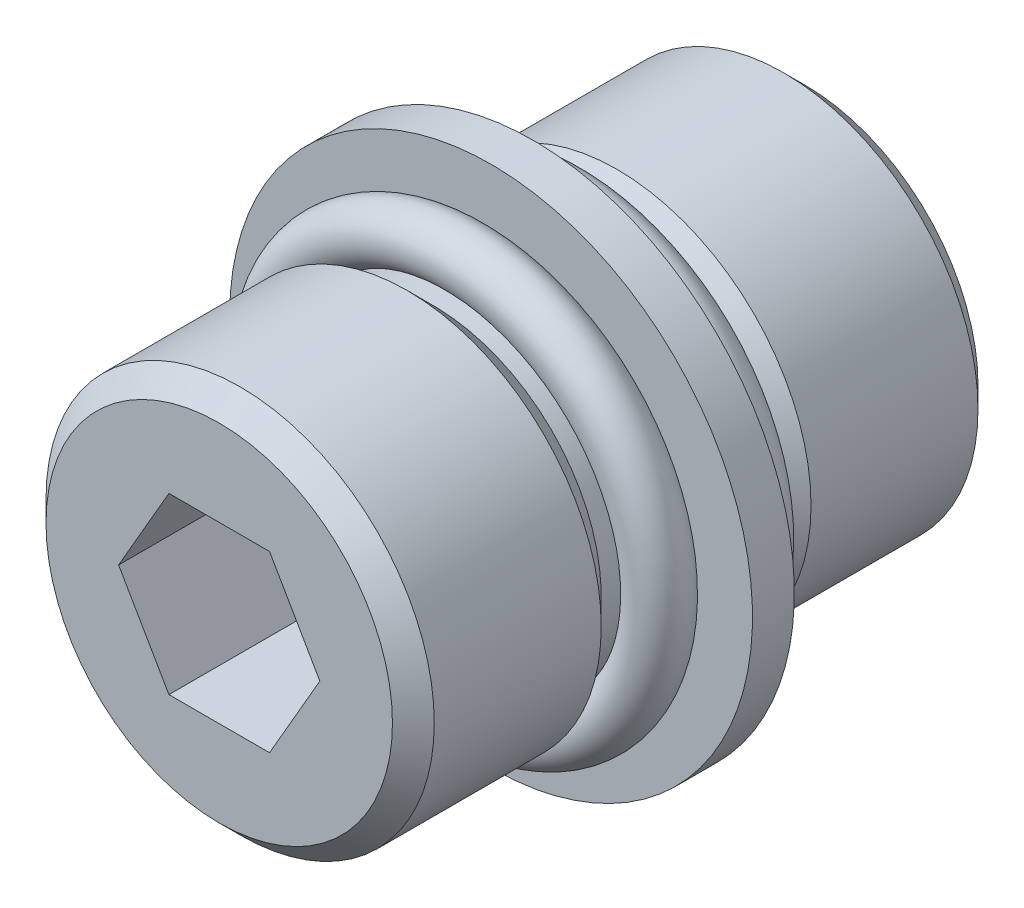
ISO-10303-21;
HEADER;
FILE_DESCRIPTION(('STEP AP214'),'2;1');
FILE_NAME('part.step','',(''),(''),'','','');
FILE_SCHEMA(('AUTOMOTIVE_DESIGN { 1 0 10303 214 1 1 1 1 }'));
ENDSEC;
DATA;
#1=APPLICATION_CONTEXT('core data for automotive mechanical design processes');
#2=APPLICATION_PROTOCOL_DEFINITION('international standard','automotive_design',2000,#1);
#3=PRODUCT_CONTEXT('',#1,'mechanical');
#4=PRODUCT('Part','Part','',(#3));
#5=PRODUCT_RELATED_PRODUCT_CATEGORY('part','',(#4));
#6=PRODUCT_DEFINITION_FORMATION('','',#4);
#7=PRODUCT_DEFINITION_CONTEXT('part definition',#1,'design');
#8=PRODUCT_DEFINITION('design','',#6,#7);
#9=PRODUCT_DEFINITION_SHAPE('','',#8);
#10=(LENGTH_UNIT() NAMED_UNIT(*) SI_UNIT(.MILLI.,.METRE.));
#11=(NAMED_UNIT(*) PLANE_ANGLE_UNIT() SI_UNIT($,.RADIAN.));
#12=(NAMED_UNIT(*) SI_UNIT($,.STERADIAN.) SOLID_ANGLE_UNIT());
#13=UNCERTAINTY_MEASURE_WITH_UNIT(LENGTH_MEASURE(1.E-05),#10,'distance_accuracy_value','');
#14=(GEOMETRIC_REPRESENTATION_CONTEXT(3) GLOBAL_UNCERTAINTY_ASSIGNED_CONTEXT((#13)) GLOBAL_UNIT_ASSIGNED_CONTEXT((#10,
#11,#12)) REPRESENTATION_CONTEXT('',''));
#15=CARTESIAN_POINT('',(0.,0.,0.));
#16=DIRECTION('',(0.,0.,1.));
#17=DIRECTION('',(1.,0.,0.));
#18=AXIS2_PLACEMENT_3D('',#15,#16,#17);
#19=CARTESIAN_POINT('',(0.,0.,2.794));
#20=DIRECTION('',(0.,0.,-1.));
#21=DIRECTION('',(-1.,0.,0.));
#22=AXIS2_PLACEMENT_3D('',#19,#20,#21);
#23=PLANE('',#22);
#24=CARTESIAN_POINT('',(0.,0.,2.794));
#25=DIRECTION('',(0.,0.,-1.));
#26=DIRECTION('',(-1.,0.,0.));
#27=AXIS2_PLACEMENT_3D('',#24,#25,#26);
#28=CIRCLE('',#27,4.9784);
#29=CARTESIAN_POINT('',(-4.9784,0.,2.794));
#30=VERTEX_POINT('',#29);
#31=EDGE_CURVE('P0_E143',#30,#30,#28,.T.);
#32=ORIENTED_EDGE('',*,*,#31,.T.);
#33=EDGE_LOOP('',(#32));
#34=FACE_BOUND('',#33,.T.);
#35=ADVANCED_FACE('P0_F16',(#34),#23,.T.);
#36=CARTESIAN_POINT('',(0.,0.,22.4028));
#37=DIRECTION('',(0.,0.,-1.));
#38=DIRECTION('',(-1.,0.,0.));
#39=AXIS2_PLACEMENT_3D('',#36,#37,#38);
#40=CYLINDRICAL_SURFACE('',#39,4.9784);
#41=CARTESIAN_POINT('',(0.,0.,0.));
#42=DIRECTION('',(0.,0.,-1.));
#43=DIRECTION('',(-1.,0.,0.));
#44=AXIS2_PLACEMENT_3D('',#41,#42,#43);
#45=CIRCLE('',#44,4.9784);
#46=CARTESIAN_POINT('',(-4.9784,0.,0.));
#47=VERTEX_POINT('',#46);
#48=EDGE_CURVE('P0_E139',#47,#47,#45,.F.);
#49=ORIENTED_EDGE('',*,*,#48,.F.);
#50=EDGE_LOOP('',(#49));
#51=FACE_BOUND('',#50,.T.);
#52=ORIENTED_EDGE('',*,*,#31,.F.);
#53=EDGE_LOOP('',(#52));
#54=FACE_BOUND('',#53,.T.);
#55=ADVANCED_FACE('P0_F468',(#51,#54),#40,.F.);
#56=CARTESIAN_POINT('',(0.,0.,0.));
#57=DIRECTION('',(0.,0.,-1.));
#58=DIRECTION('',(-1.,0.,0.));
#59=AXIS2_PLACEMENT_3D('',#56,#57,#58);
#60=PLANE('',#59);
#61=ORIENTED_EDGE('',*,*,#48,.T.);
#62=EDGE_LOOP('',(#61));
#63=FACE_BOUND('',#62,.T.);
#64=CARTESIAN_POINT('',(0.,0.,0.));
#65=DIRECTION('',(0.,0.,1.));
#66=DIRECTION('',(1.,0.,0.));
#67=AXIS2_PLACEMENT_3D('',#64,#65,#66);
#68=CIRCLE('',#67,6.3118999999574);
#69=CARTESIAN_POINT('',(6.3118999999574,0.,0.));
#70=VERTEX_POINT('',#69);
#71=EDGE_CURVE('P0_E103',#70,#70,#68,.T.);
#72=ORIENTED_EDGE('',*,*,#71,.F.);
#73=EDGE_LOOP('',(#72));
#74=FACE_BOUND('',#73,.T.);
#75=ADVANCED_FACE('P0_F461',(#63,#74),#60,.T.);
#76=CARTESIAN_POINT('',(0.,0.,7.62));
#77=DIRECTION('',(0.,0.,-1.));
#78=DIRECTION('',(-1.,0.,0.));
#79=AXIS2_PLACEMENT_3D('',#76,#77,#78);
#80=PLANE('',#79);
#81=DIRECTION('',(1.,0.,0.));
#82=VECTOR('',#81,1.);
#83=CARTESIAN_POINT('',(-1.83308710467698,-3.175,7.62));
#84=LINE('',#83,#82);
#85=CARTESIAN_POINT('',(-1.83308710467695,-3.17499999999998,7.62));
#86=VERTEX_POINT('',#85);
#87=CARTESIAN_POINT('',(1.83308710467698,-3.175,7.62));
#88=VERTEX_POINT('',#87);
#89=EDGE_CURVE('P0_E78',#86,#88,#84,.T.);
#90=ORIENTED_EDGE('',*,*,#89,.T.);
#91=DIRECTION('',(0.500000000000017,0.866025403784429,0.));
#92=VECTOR('',#91,1.);
#93=CARTESIAN_POINT('',(1.83308710467698,-3.175,7.62));
#94=LINE('',#93,#92);
#95=CARTESIAN_POINT('',(3.66617420935399,0.,7.62));
#96=VERTEX_POINT('',#95);
#97=EDGE_CURVE('P0_E295',#88,#96,#94,.T.);
#98=ORIENTED_EDGE('',*,*,#97,.T.);
#99=DIRECTION('',(-0.500000000000017,0.866025403784429,0.));
#100=VECTOR('',#99,1.);
#101=CARTESIAN_POINT('',(3.66617420935396,0.,7.62));
#102=LINE('',#101,#100);
#103=CARTESIAN_POINT('',(1.83308710467695,3.17499999999998,7.62));
#104=VERTEX_POINT('',#103);
#105=EDGE_CURVE('P0_E289',#96,#104,#102,.T.);
#106=ORIENTED_EDGE('',*,*,#105,.T.);
#107=DIRECTION('',(1.,0.,0.));
#108=VECTOR('',#107,1.);
#109=CARTESIAN_POINT('',(1.83308710467698,3.175,7.62));
#110=LINE('',#109,#108);
#111=CARTESIAN_POINT('',(-1.83308710467698,3.175,7.62));
#112=VERTEX_POINT('',#111);
#113=EDGE_CURVE('P0_E98',#104,#112,#110,.F.);
#114=ORIENTED_EDGE('',*,*,#113,.T.);
#115=DIRECTION('',(-0.500000000000017,-0.866025403784429,0.));
#116=VECTOR('',#115,1.);
#117=CARTESIAN_POINT('',(-1.83308710467698,3.175,7.62));
#118=LINE('',#117,#116);
#119=CARTESIAN_POINT('',(-3.66617420935399,0.,7.62));
#120=VERTEX_POINT('',#119);
#121=EDGE_CURVE('P0_E93',#112,#120,#118,.T.);
#122=ORIENTED_EDGE('',*,*,#121,.T.);
#123=DIRECTION('',(0.500000000000017,-0.866025403784429,0.));
#124=VECTOR('',#123,1.);
#125=CARTESIAN_POINT('',(-3.66617420935396,0.,7.62));
#126=LINE('',#125,#124);
#127=EDGE_CURVE('P0_E83',#120,#86,#126,.T.);
#128=ORIENTED_EDGE('',*,*,#127,.T.);
#129=EDGE_LOOP('',(#90,#98,#106,#114,#122,#128));
#130=FACE_BOUND('',#129,.T.);
#131=ADVANCED_FACE('P0_F96',(#130),#80,.F.);
#132=CARTESIAN_POINT('',(0.,0.,0.761999999951968));
#133=DIRECTION('',(0.,0.,1.));
#134=DIRECTION('',(1.,0.,0.));
#135=AXIS2_PLACEMENT_3D('',#132,#133,#134);
#136=CONICAL_SURFACE('',#135,7.07389999990937,0.785398163397448);
#137=ORIENTED_EDGE('',*,*,#71,.T.);
#138=EDGE_LOOP('',(#137));
#139=FACE_BOUND('',#138,.T.);
#140=CARTESIAN_POINT('',(0.,0.,0.761999999999999));
#141=DIRECTION('',(0.,0.,-1.));
#142=DIRECTION('',(-1.,0.,0.));
#143=AXIS2_PLACEMENT_3D('',#140,#141,#142);
#144=CIRCLE('',#143,7.0739);
#145=CARTESIAN_POINT('',(-7.0739,0.,0.761999999999999));
#146=VERTEX_POINT('',#145);
#147=EDGE_CURVE('P0_E115',#146,#146,#144,.F.);
#148=ORIENTED_EDGE('',*,*,#147,.F.);
#149=EDGE_LOOP('',(#148));
#150=FACE_BOUND('',#149,.T.);
#151=ADVANCED_FACE('P0_F447',(#139,#150),#136,.T.);
#152=CARTESIAN_POINT('',(-1.83308710467698,3.175,21.336));
#153=DIRECTION('',(-0.866025403784429,0.500000000000017,0.));
#154=DIRECTION('',(-0.500000000000017,-0.866025403784429,0.));
#155=AXIS2_PLACEMENT_3D('',#152,#153,#154);
#156=PLANE('',#155);
#157=DIRECTION('',(-0.499999999999983,-0.866025403784448,0.));
#158=VECTOR('',#157,1.);
#159=CARTESIAN_POINT('',(-1.83308710467698,3.175,21.336));
#160=LINE('',#159,#158);
#161=CARTESIAN_POINT('',(-1.83308710467698,3.175,21.336));
#162=VERTEX_POINT('',#161);
#163=CARTESIAN_POINT('',(-3.66617420935402,0.,21.336));
#164=VERTEX_POINT('',#163);
#165=EDGE_CURVE('P0_E107',#162,#164,#160,.T.);
#166=ORIENTED_EDGE('',*,*,#165,.T.);
#167=DIRECTION('',(0.,0.,1.));
#168=VECTOR('',#167,1.);
#169=CARTESIAN_POINT('',(-3.66617420935396,0.,21.336));
#170=LINE('',#169,#168);
#171=EDGE_CURVE('P0_E88',#164,#120,#170,.F.);
#172=ORIENTED_EDGE('',*,*,#171,.T.);
#173=ORIENTED_EDGE('',*,*,#121,.F.);
#174=DIRECTION('',(0.,0.,1.));
#175=VECTOR('',#174,1.);
#176=CARTESIAN_POINT('',(-1.83308710467698,3.175,21.336));
#177=LINE('',#176,#175);
#178=EDGE_CURVE('P0_E280',#112,#162,#177,.T.);
#179=ORIENTED_EDGE('',*,*,#178,.T.);
#180=EDGE_LOOP('',(#166,#172,#173,#179));
#181=FACE_BOUND('',#180,.T.);
#182=ADVANCED_FACE('P0_F106',(#181),#156,.F.);
#183=CARTESIAN_POINT('',(-3.66617420935396,0.,21.336));
#184=DIRECTION('',(-0.866025403784429,-0.500000000000017,0.));
#185=DIRECTION('',(0.500000000000017,-0.866025403784429,0.));
#186=AXIS2_PLACEMENT_3D('',#183,#184,#185);
#187=PLANE('',#186);
#188=DIRECTION('',(0.499999999999983,-0.866025403784448,0.));
#189=VECTOR('',#188,1.);
#190=CARTESIAN_POINT('',(-3.66617420935396,0.,21.336));
#191=LINE('',#190,#189);
#192=CARTESIAN_POINT('',(-1.83308710467692,-3.17499999999996,21.336));
#193=VERTEX_POINT('',#192);
#194=EDGE_CURVE('P0_E269',#164,#193,#191,.T.);
#195=ORIENTED_EDGE('',*,*,#194,.T.);
#196=DIRECTION('',(0.,0.,-1.));
#197=VECTOR('',#196,1.);
#198=CARTESIAN_POINT('',(-1.83308710467698,-3.175,21.336));
#199=LINE('',#198,#197);
#200=EDGE_CURVE('P0_E90',#193,#86,#199,.T.);
#201=ORIENTED_EDGE('',*,*,#200,.T.);
#202=ORIENTED_EDGE('',*,*,#127,.F.);
#203=ORIENTED_EDGE('',*,*,#171,.F.);
#204=EDGE_LOOP('',(#195,#201,#202,#203));
#205=FACE_BOUND('',#204,.T.);
#206=ADVANCED_FACE('P0_F86',(#205),#187,.F.);
#207=CARTESIAN_POINT('',(-1.83308710467698,-3.175,21.336));
#208=DIRECTION('',(0.,-1.,0.));
#209=DIRECTION('',(0.,0.,-1.));
#210=AXIS2_PLACEMENT_3D('',#207,#208,#209);
#211=PLANE('',#210);
#212=DIRECTION('',(-1.,0.,0.));
#213=VECTOR('',#212,1.);
#214=CARTESIAN_POINT('',(0.,-3.175,21.336));
#215=LINE('',#214,#213);
#216=CARTESIAN_POINT('',(1.83308710467698,-3.175,21.336));
#217=VERTEX_POINT('',#216);
#218=EDGE_CURVE('P0_E265',#193,#217,#215,.F.);
#219=ORIENTED_EDGE('',*,*,#218,.T.);
#220=DIRECTION('',(0.,0.,1.));
#221=VECTOR('',#220,1.);
#222=CARTESIAN_POINT('',(1.83308710467698,-3.175,21.336));
#223=LINE('',#222,#221);
#224=EDGE_CURVE('P0_E292',#217,#88,#223,.F.);
#225=ORIENTED_EDGE('',*,*,#224,.T.);
#226=ORIENTED_EDGE('',*,*,#89,.F.);
#227=ORIENTED_EDGE('',*,*,#200,.F.);
#228=EDGE_LOOP('',(#219,#225,#226,#227));
#229=FACE_BOUND('',#228,.T.);
#230=ADVANCED_FACE('P0_F427',(#229),#211,.F.);
#231=CARTESIAN_POINT('',(1.83308710467698,-3.175,21.336));
#232=DIRECTION('',(0.866025403784429,-0.500000000000017,0.));
#233=DIRECTION('',(0.500000000000017,0.866025403784429,0.));
#234=AXIS2_PLACEMENT_3D('',#231,#232,#233);
#235=PLANE('',#234);
#236=DIRECTION('',(0.499999999999983,0.866025403784448,0.));
#237=VECTOR('',#236,1.);
#238=CARTESIAN_POINT('',(1.83308710467698,-3.175,21.336));
#239=LINE('',#238,#237);
#240=CARTESIAN_POINT('',(3.66617420935402,0.,21.336));
#241=VERTEX_POINT('',#240);
#242=EDGE_CURVE('P0_E261',#217,#241,#239,.T.);
#243=ORIENTED_EDGE('',*,*,#242,.T.);
#244=DIRECTION('',(0.,0.,1.));
#245=VECTOR('',#244,1.);
#246=CARTESIAN_POINT('',(3.66617420935396,0.,21.336));
#247=LINE('',#246,#245);
#248=EDGE_CURVE('P0_E285',#241,#96,#247,.F.);
#249=ORIENTED_EDGE('',*,*,#248,.T.);
#250=ORIENTED_EDGE('',*,*,#97,.F.);
#251=ORIENTED_EDGE('',*,*,#224,.F.);
#252=EDGE_LOOP('',(#243,#249,#250,#251));
#253=FACE_BOUND('',#252,.T.);
#254=ADVANCED_FACE('P0_F419',(#253),#235,.F.);
#255=CARTESIAN_POINT('',(3.66617420935396,0.,21.336));
#256=DIRECTION('',(0.866025403784429,0.500000000000017,0.));
#257=DIRECTION('',(-0.500000000000017,0.866025403784429,0.));
#258=AXIS2_PLACEMENT_3D('',#255,#256,#257);
#259=PLANE('',#258);
#260=DIRECTION('',(-0.499999999999983,0.866025403784448,0.));
#261=VECTOR('',#260,1.);
#262=CARTESIAN_POINT('',(3.66617420935396,0.,21.336));
#263=LINE('',#262,#261);
#264=CARTESIAN_POINT('',(1.83308710467692,3.17499999999996,21.336));
#265=VERTEX_POINT('',#264);
#266=EDGE_CURVE('P0_E257',#241,#265,#263,.T.);
#267=ORIENTED_EDGE('',*,*,#266,.T.);
#268=DIRECTION('',(0.,0.,1.));
#269=VECTOR('',#268,1.);
#270=CARTESIAN_POINT('',(1.83308710467698,3.175,21.336));
#271=LINE('',#270,#269);
#272=EDGE_CURVE('P0_E119',#265,#104,#271,.F.);
#273=ORIENTED_EDGE('',*,*,#272,.T.);
#274=ORIENTED_EDGE('',*,*,#105,.F.);
#275=ORIENTED_EDGE('',*,*,#248,.F.);
#276=EDGE_LOOP('',(#267,#273,#274,#275));
#277=FACE_BOUND('',#276,.T.);
#278=ADVANCED_FACE('P0_F411',(#277),#259,.F.);
#279=CARTESIAN_POINT('',(1.83308710467698,3.175,21.336));
#280=DIRECTION('',(0.,1.,0.));
#281=DIRECTION('',(0.,0.,1.));
#282=AXIS2_PLACEMENT_3D('',#279,#280,#281);
#283=PLANE('',#282);
#284=DIRECTION('',(-1.,0.,0.));
#285=VECTOR('',#284,1.);
#286=CARTESIAN_POINT('',(0.,3.175,21.336));
#287=LINE('',#286,#285);
#288=EDGE_CURVE('P0_E253',#265,#162,#287,.T.);
#289=ORIENTED_EDGE('',*,*,#288,.T.);
#290=ORIENTED_EDGE('',*,*,#178,.F.);
#291=ORIENTED_EDGE('',*,*,#113,.F.);
#292=ORIENTED_EDGE('',*,*,#272,.F.);
#293=EDGE_LOOP('',(#289,#290,#291,#292));
#294=FACE_BOUND('',#293,.T.);
#295=ADVANCED_FACE('P0_F403',(#294),#283,.F.);
#296=CARTESIAN_POINT('',(0.,0.,22.4028));
#297=DIRECTION('',(0.,0.,-1.));
#298=DIRECTION('',(-1.,0.,0.));
#299=AXIS2_PLACEMENT_3D('',#296,#297,#298);
#300=CYLINDRICAL_SURFACE('',#299,7.0739);
#301=CARTESIAN_POINT('',(0.,0.,6.84530000006589));
#302=DIRECTION('',(0.,0.,-1.));
#303=DIRECTION('',(0.,-1.,0.));
#304=AXIS2_PLACEMENT_3D('',#301,#302,#303);
#305=CIRCLE('',#304,7.07389999996622);
#306=CARTESIAN_POINT('',(0.,-7.07389999996622,6.84530000006589));
#307=VERTEX_POINT('',#306);
#308=EDGE_CURVE('P0_E135',#307,#307,#305,.F.);
#309=ORIENTED_EDGE('',*,*,#308,.F.);
#310=EDGE_LOOP('',(#309));
#311=FACE_BOUND('',#310,.T.);
#312=ORIENTED_EDGE('',*,*,#147,.T.);
#313=EDGE_LOOP('',(#312));
#314=FACE_BOUND('',#313,.T.);
#315=ADVANCED_FACE('P0_F395',(#311,#314),#300,.T.);
#316=CARTESIAN_POINT('',(0.,0.,21.336));
#317=DIRECTION('',(0.,0.,-1.));
#318=DIRECTION('',(-1.,0.,0.));
#319=AXIS2_PLACEMENT_3D('',#316,#317,#318);
#320=PLANE('',#319);
#321=ORIENTED_EDGE('',*,*,#266,.F.);
#322=ORIENTED_EDGE('',*,*,#242,.F.);
#323=ORIENTED_EDGE('',*,*,#218,.F.);
#324=ORIENTED_EDGE('',*,*,#194,.F.);
#325=ORIENTED_EDGE('',*,*,#165,.F.);
#326=ORIENTED_EDGE('',*,*,#288,.F.);
#327=EDGE_LOOP('',(#321,#322,#323,#324,#325,#326));
#328=FACE_BOUND('',#327,.T.);
#329=CARTESIAN_POINT('',(0.,0.,21.3359999999625));
#330=DIRECTION('',(0.,0.,-1.));
#331=DIRECTION('',(-1.,0.,0.));
#332=AXIS2_PLACEMENT_3D('',#329,#330,#331);
#333=CIRCLE('',#332,6.3118999999574);
#334=CARTESIAN_POINT('',(-6.3118999999574,0.,21.3359999999625));
#335=VERTEX_POINT('',#334);
#336=EDGE_CURVE('P0_E130',#335,#335,#333,.T.);
#337=ORIENTED_EDGE('',*,*,#336,.F.);
#338=EDGE_LOOP('',(#337));
#339=FACE_BOUND('',#338,.T.);
#340=ADVANCED_FACE('P0_F387',(#328,#339),#320,.F.);
#341=CARTESIAN_POINT('',(0.,0.,6.84530000012273));
#342=DIRECTION('',(0.,0.,-1.));
#343=DIRECTION('',(-1.,0.,0.));
#344=AXIS2_PLACEMENT_3D('',#341,#342,#343);
#345=CONICAL_SURFACE('',#344,7.07389999990937,0.785398163397448);
#346=CARTESIAN_POINT('',(0.,0.,7.7978));
#347=DIRECTION('',(0.,0.,-1.));
#348=DIRECTION('',(-1.,0.,0.));
#349=AXIS2_PLACEMENT_3D('',#346,#347,#348);
#350=CIRCLE('',#349,6.1214);
#351=CARTESIAN_POINT('',(-6.1214,0.,7.7978));
#352=VERTEX_POINT('',#351);
#353=EDGE_CURVE('P0_E134',#352,#352,#350,.F.);
#354=ORIENTED_EDGE('',*,*,#353,.F.);
#355=EDGE_LOOP('',(#354));
#356=FACE_BOUND('',#355,.T.);
#357=ORIENTED_EDGE('',*,*,#308,.T.);
#358=EDGE_LOOP('',(#357));
#359=FACE_BOUND('',#358,.T.);
#360=ADVANCED_FACE('P0_F379',(#356,#359),#345,.T.);
#361=CARTESIAN_POINT('',(0.,0.,20.5740000000105));
#362=DIRECTION('',(0.,0.,-1.));
#363=DIRECTION('',(-1.,0.,0.));
#364=AXIS2_PLACEMENT_3D('',#361,#362,#363);
#365=CONICAL_SURFACE('',#364,7.07389999996622,0.785398163434747);
#366=CARTESIAN_POINT('',(0.,0.,20.574));
#367=DIRECTION('',(0.,0.,-1.));
#368=DIRECTION('',(-1.,0.,0.));
#369=AXIS2_PLACEMENT_3D('',#366,#367,#368);
#370=CIRCLE('',#369,7.0739);
#371=CARTESIAN_POINT('',(-7.0739,0.,20.574));
#372=VERTEX_POINT('',#371);
#373=EDGE_CURVE('P0_E246',#372,#372,#370,.T.);
#374=ORIENTED_EDGE('',*,*,#373,.F.);
#375=EDGE_LOOP('',(#374));
#376=FACE_BOUND('',#375,.T.);
#377=ORIENTED_EDGE('',*,*,#336,.T.);
#378=EDGE_LOOP('',(#377));
#379=FACE_BOUND('',#378,.T.);
#380=ADVANCED_FACE('P0_F372',(#376,#379),#365,.T.);
#381=CARTESIAN_POINT('',(0.,0.,22.4028));
#382=DIRECTION('',(0.,0.,-1.));
#383=DIRECTION('',(-1.,0.,0.));
#384=AXIS2_PLACEMENT_3D('',#381,#382,#383);
#385=CYLINDRICAL_SURFACE('',#384,6.1214);
#386=ORIENTED_EDGE('',*,*,#353,.T.);
#387=EDGE_LOOP('',(#386));
#388=FACE_BOUND('',#387,.T.);
#389=CARTESIAN_POINT('',(0.,0.,9.398));
#390=DIRECTION('',(0.,0.,-1.));
#391=DIRECTION('',(0.0127604835520099,-0.999918581715291,0.));
#392=AXIS2_PLACEMENT_3D('',#389,#390,#391);
#393=CIRCLE('',#392,6.1214);
#394=CARTESIAN_POINT('',(0.0781120240152733,-6.12090160611198,9.398));
#395=VERTEX_POINT('',#394);
#396=EDGE_CURVE('P0_E242',#395,#395,#393,.T.);
#397=ORIENTED_EDGE('',*,*,#396,.T.);
#398=EDGE_LOOP('',(#397));
#399=FACE_BOUND('',#398,.T.);
#400=ADVANCED_FACE('P0_F365',(#388,#399),#385,.T.);
#401=CARTESIAN_POINT('',(0.,0.,22.4028));
#402=DIRECTION('',(0.,0.,-1.));
#403=DIRECTION('',(-1.,0.,0.));
#404=AXIS2_PLACEMENT_3D('',#401,#402,#403);
#405=CYLINDRICAL_SURFACE('',#404,7.0739);
#406=CARTESIAN_POINT('',(0.,0.,14.4906999999534));
#407=DIRECTION('',(0.,0.,1.));
#408=DIRECTION('',(0.,1.,0.));
#409=AXIS2_PLACEMENT_3D('',#406,#407,#408);
#410=CIRCLE('',#409,7.07390000002306);
#411=CARTESIAN_POINT('',(0.,7.07390000002306,14.4906999999534));
#412=VERTEX_POINT('',#411);
#413=EDGE_CURVE('P0_E233',#412,#412,#410,.F.);
#414=ORIENTED_EDGE('',*,*,#413,.F.);
#415=EDGE_LOOP('',(#414));
#416=FACE_BOUND('',#415,.T.);
#417=ORIENTED_EDGE('',*,*,#373,.T.);
#418=EDGE_LOOP('',(#417));
#419=FACE_BOUND('',#418,.T.);
#420=ADVANCED_FACE('P0_F226',(#416,#419),#405,.T.);
#421=CARTESIAN_POINT('',(0.,0.,9.398));
#422=DIRECTION('',(0.,0.,-1.));
#423=DIRECTION('',(0.0127604835520099,-0.999918581715291,0.));
#424=AXIS2_PLACEMENT_3D('',#421,#422,#423);
#425=TOROIDAL_SURFACE('',#424,6.6294,0.508);
#426=ORIENTED_EDGE('',*,*,#396,.F.);
#427=EDGE_LOOP('',(#426));
#428=FACE_BOUND('',#427,.T.);
#429=CARTESIAN_POINT('',(0.,0.,9.906));
#430=DIRECTION('',(0.,0.,-1.));
#431=DIRECTION('',(0.,1.,0.));
#432=AXIS2_PLACEMENT_3D('',#429,#430,#431);
#433=CIRCLE('',#432,6.6294);
#434=CARTESIAN_POINT('',(0.,-6.6294,9.906));
#435=VERTEX_POINT('',#434);
#436=CARTESIAN_POINT('',(0.,6.6294,9.906));
#437=VERTEX_POINT('',#436);
#438=EDGE_CURVE('P0_E188',#435,#437,#433,.F.);
#439=ORIENTED_EDGE('',*,*,#438,.F.);
#440=CARTESIAN_POINT('',(0.,0.,9.906));
#441=DIRECTION('',(0.,0.,-1.));
#442=DIRECTION('',(0.,-1.,0.));
#443=AXIS2_PLACEMENT_3D('',#440,#441,#442);
#444=CIRCLE('',#443,6.6294);
#445=EDGE_CURVE('P0_E218',#437,#435,#444,.F.);
#446=ORIENTED_EDGE('',*,*,#445,.F.);
#447=EDGE_LOOP('',(#439,#446));
#448=FACE_BOUND('',#447,.T.);
#449=ADVANCED_FACE('P0_F222',(#428,#448),#425,.F.);
#450=CARTESIAN_POINT('',(0.,0.,14.4906999998966));
#451=DIRECTION('',(0.,0.,1.));
#452=DIRECTION('',(1.,0.,0.));
#453=AXIS2_PLACEMENT_3D('',#450,#451,#452);
#454=CONICAL_SURFACE('',#453,7.07389999996622,0.785398163397448);
#455=CARTESIAN_POINT('',(0.,0.,13.5382));
#456=DIRECTION('',(0.,0.,-1.));
#457=DIRECTION('',(-1.,0.,0.));
#458=AXIS2_PLACEMENT_3D('',#455,#456,#457);
#459=CIRCLE('',#458,6.1214);
#460=CARTESIAN_POINT('',(-6.1214,0.,13.5382));
#461=VERTEX_POINT('',#460);
#462=EDGE_CURVE('P0_E129',#461,#461,#459,.T.);
#463=ORIENTED_EDGE('',*,*,#462,.F.);
#464=EDGE_LOOP('',(#463));
#465=FACE_BOUND('',#464,.T.);
#466=ORIENTED_EDGE('',*,*,#413,.T.);
#467=EDGE_LOOP('',(#466));
#468=FACE_BOUND('',#467,.T.);
#469=ADVANCED_FACE('P0_F205',(#465,#468),#454,.T.);
#470=CARTESIAN_POINT('',(0.,0.,9.906));
#471=DIRECTION('',(0.,0.,-1.));
#472=DIRECTION('',(-1.,0.,0.));
#473=AXIS2_PLACEMENT_3D('',#470,#471,#472);
#474=PLANE('',#473);
#475=ORIENTED_EDGE('',*,*,#438,.T.);
#476=ORIENTED_EDGE('',*,*,#445,.T.);
#477=EDGE_LOOP('',(#475,#476));
#478=FACE_BOUND('',#477,.T.);
#479=CARTESIAN_POINT('',(0.,0.,9.906));
#480=DIRECTION('',(0.,0.,-1.));
#481=DIRECTION('',(-1.,0.,0.));
#482=AXIS2_PLACEMENT_3D('',#479,#480,#481);
#483=CIRCLE('',#482,9.525);
#484=CARTESIAN_POINT('',(-9.525,0.,9.906));
#485=VERTEX_POINT('',#484);
#486=EDGE_CURVE('P0_E125',#485,#485,#483,.F.);
#487=ORIENTED_EDGE('',*,*,#486,.F.);
#488=EDGE_LOOP('',(#487));
#489=FACE_BOUND('',#488,.T.);
#490=ADVANCED_FACE('P0_F195',(#478,#489),#474,.T.);
#491=CARTESIAN_POINT('',(0.,0.,22.4028));
#492=DIRECTION('',(0.,0.,-1.));
#493=DIRECTION('',(-1.,0.,0.));
#494=AXIS2_PLACEMENT_3D('',#491,#492,#493);
#495=CYLINDRICAL_SURFACE('',#494,6.1214);
#496=ORIENTED_EDGE('',*,*,#462,.T.);
#497=EDGE_LOOP('',(#496));
#498=FACE_BOUND('',#497,.T.);
#499=CARTESIAN_POINT('',(0.,0.,11.938));
#500=DIRECTION('',(0.,0.,-1.));
#501=DIRECTION('',(-0.0133758666735105,0.999910539093739,0.));
#502=AXIS2_PLACEMENT_3D('',#499,#500,#501);
#503=CIRCLE('',#502,6.1214);
#504=CARTESIAN_POINT('',(-0.0818790302552273,6.12085237400842,11.938));
#505=VERTEX_POINT('',#504);
#506=EDGE_CURVE('P0_E124',#505,#505,#503,.F.);
#507=ORIENTED_EDGE('',*,*,#506,.T.);
#508=EDGE_LOOP('',(#507));
#509=FACE_BOUND('',#508,.T.);
#510=ADVANCED_FACE('P0_F204',(#498,#509),#495,.T.);
#511=CARTESIAN_POINT('',(0.,0.,22.4028));
#512=DIRECTION('',(0.,0.,-1.));
#513=DIRECTION('',(-1.,0.,0.));
#514=AXIS2_PLACEMENT_3D('',#511,#512,#513);
#515=CYLINDRICAL_SURFACE('',#514,9.525);
#516=CARTESIAN_POINT('',(0.,0.,11.43));
#517=DIRECTION('',(0.,0.,-1.));
#518=DIRECTION('',(-1.,0.,0.));
#519=AXIS2_PLACEMENT_3D('',#516,#517,#518);
#520=CIRCLE('',#519,9.525);
#521=CARTESIAN_POINT('',(-9.525,0.,11.43));
#522=VERTEX_POINT('',#521);
#523=EDGE_CURVE('P0_E120',#522,#522,#520,.T.);
#524=ORIENTED_EDGE('',*,*,#523,.T.);
#525=EDGE_LOOP('',(#524));
#526=FACE_BOUND('',#525,.T.);
#527=ORIENTED_EDGE('',*,*,#486,.T.);
#528=EDGE_LOOP('',(#527));
#529=FACE_BOUND('',#528,.T.);
#530=ADVANCED_FACE('P0_F165',(#526,#529),#515,.T.);
#531=CARTESIAN_POINT('',(0.,0.,11.938));
#532=DIRECTION('',(0.,0.,-1.));
#533=DIRECTION('',(-0.0133758666735105,0.999910539093739,0.));
#534=AXIS2_PLACEMENT_3D('',#531,#532,#533);
#535=TOROIDAL_SURFACE('',#534,6.6294,0.508);
#536=CARTESIAN_POINT('',(0.,0.,11.43));
#537=DIRECTION('',(0.,0.,1.));
#538=DIRECTION('',(0.,-1.,0.));
#539=AXIS2_PLACEMENT_3D('',#536,#537,#538);
#540=CIRCLE('',#539,6.6294);
#541=CARTESIAN_POINT('',(0.,-6.6294,11.43));
#542=VERTEX_POINT('',#541);
#543=CARTESIAN_POINT('',(0.,6.6294,11.43));
#544=VERTEX_POINT('',#543);
#545=EDGE_CURVE('P0_E10',#542,#544,#540,.T.);
#546=ORIENTED_EDGE('',*,*,#545,.T.);
#547=CARTESIAN_POINT('',(0.,0.,11.43));
#548=DIRECTION('',(0.,0.,1.));
#549=DIRECTION('',(0.,1.,0.));
#550=AXIS2_PLACEMENT_3D('',#547,#548,#549);
#551=CIRCLE('',#550,6.6294);
#552=EDGE_CURVE('P0_E28',#544,#542,#551,.T.);
#553=ORIENTED_EDGE('',*,*,#552,.T.);
#554=EDGE_LOOP('',(#546,#553));
#555=FACE_BOUND('',#554,.T.);
#556=ORIENTED_EDGE('',*,*,#506,.F.);
#557=EDGE_LOOP('',(#556));
#558=FACE_BOUND('',#557,.T.);
#559=ADVANCED_FACE('P0_F153',(#555,#558),#535,.F.);
#560=CARTESIAN_POINT('',(0.,0.,11.43));
#561=DIRECTION('',(0.,0.,-1.));
#562=DIRECTION('',(-1.,0.,0.));
#563=AXIS2_PLACEMENT_3D('',#560,#561,#562);
#564=PLANE('',#563);
#565=ORIENTED_EDGE('',*,*,#552,.F.);
#566=ORIENTED_EDGE('',*,*,#545,.F.);
#567=EDGE_LOOP('',(#565,#566));
#568=FACE_BOUND('',#567,.T.);
#569=ORIENTED_EDGE('',*,*,#523,.F.);
#570=EDGE_LOOP('',(#569));
#571=FACE_BOUND('',#570,.T.);
#572=ADVANCED_FACE('P0_F164',(#568,#571),#564,.F.);
#573=CLOSED_SHELL('',(#35,#55,#75,#131,#151,#182,#206,#230,#254,#278,#295,#315,#340,#360,#380,
#400,#420,#449,#469,#490,#510,#530,#559,#572));
#574=MANIFOLD_SOLID_BREP('P0_B1',#573);
#575=CARTESIAN_POINT('',(0.,0.,12.4206));
#576=DIRECTION('',(0.,0.,-1.));
#577=DIRECTION('',(0.,-1.,0.));
#578=AXIS2_PLACEMENT_3D('',#575,#576,#577);
#579=TOROIDAL_SURFACE('',#578,7.112,0.9906);
#580=ADVANCED_FACE('P1_F14',(),#579,.T.);
#581=CLOSED_SHELL('',(#580));
#582=MANIFOLD_SOLID_BREP('P1_B1',#581);
#583=CARTESIAN_POINT('',(0.,0.,8.9154));
#584=DIRECTION('',(0.,0.,-1.));
#585=DIRECTION('',(0.,-1.,0.));
#586=AXIS2_PLACEMENT_3D('',#583,#584,#585);
#587=TOROIDAL_SURFACE('',#586,7.112,0.9906);
#588=ADVANCED_FACE('P2_F14',(),#587,.T.);
#589=CLOSED_SHELL('',(#588));
#590=MANIFOLD_SOLID_BREP('P2_B1',#589);
#591=ADVANCED_BREP_SHAPE_REPRESENTATION('',(#18,#574,#582,#590),#14);
#592=SHAPE_DEFINITION_REPRESENTATION(#9,#591);
ENDSEC;
END-ISO-10303-21;
